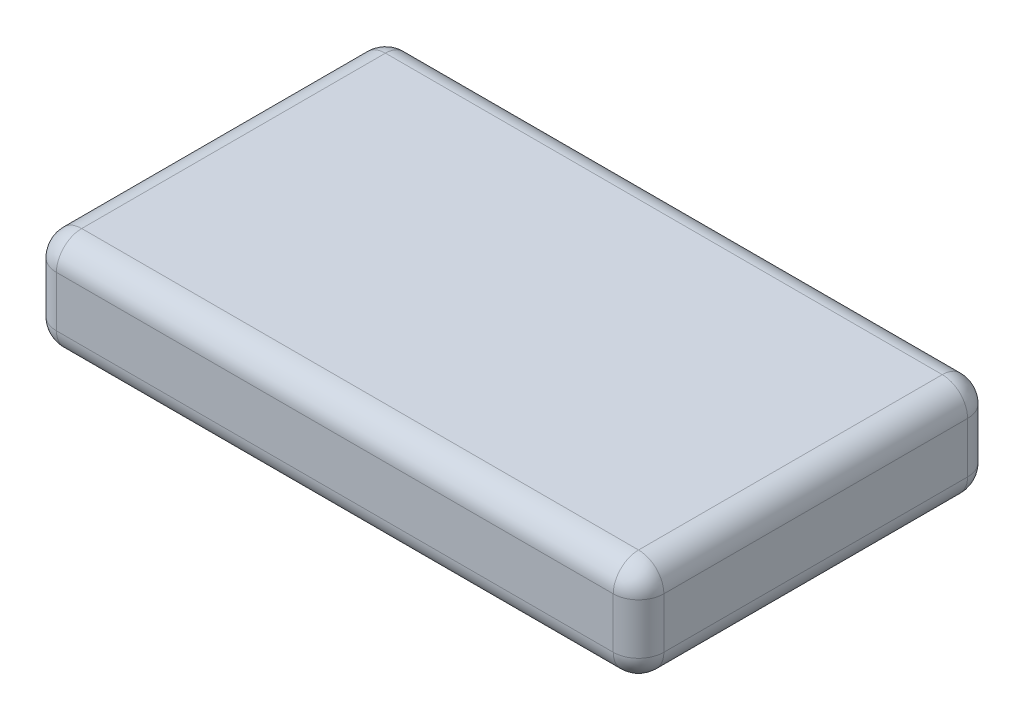
ISO-10303-21;
HEADER;
FILE_DESCRIPTION(('STEP AP214'),'2;1');
FILE_NAME('part.step','',(''),(''),'','','');
FILE_SCHEMA(('AUTOMOTIVE_DESIGN { 1 0 10303 214 1 1 1 1 }'));
ENDSEC;
DATA;
#1=APPLICATION_CONTEXT('core data for automotive mechanical design processes');
#2=APPLICATION_PROTOCOL_DEFINITION('international standard','automotive_design',2000,#1);
#3=PRODUCT_CONTEXT('',#1,'mechanical');
#4=PRODUCT('Part','Part','',(#3));
#5=PRODUCT_RELATED_PRODUCT_CATEGORY('part','',(#4));
#6=PRODUCT_DEFINITION_FORMATION('','',#4);
#7=PRODUCT_DEFINITION_CONTEXT('part definition',#1,'design');
#8=PRODUCT_DEFINITION('design','',#6,#7);
#9=PRODUCT_DEFINITION_SHAPE('','',#8);
#10=(LENGTH_UNIT() NAMED_UNIT(*) SI_UNIT(.MILLI.,.METRE.));
#11=(NAMED_UNIT(*) PLANE_ANGLE_UNIT() SI_UNIT($,.RADIAN.));
#12=(NAMED_UNIT(*) SI_UNIT($,.STERADIAN.) SOLID_ANGLE_UNIT());
#13=UNCERTAINTY_MEASURE_WITH_UNIT(LENGTH_MEASURE(1.E-05),#10,'distance_accuracy_value','');
#14=(GEOMETRIC_REPRESENTATION_CONTEXT(3) GLOBAL_UNCERTAINTY_ASSIGNED_CONTEXT((#13)) GLOBAL_UNIT_ASSIGNED_CONTEXT((#10,
#11,#12)) REPRESENTATION_CONTEXT('',''));
#15=CARTESIAN_POINT('',(0.,0.,0.));
#16=DIRECTION('',(0.,0.,1.));
#17=DIRECTION('',(1.,0.,0.));
#18=AXIS2_PLACEMENT_3D('',#15,#16,#17);
#19=CARTESIAN_POINT('',(0.,101.6,-355.6));
#20=DIRECTION('',(1.,0.,0.));
#21=DIRECTION('',(0.,0.,-1.));
#22=AXIS2_PLACEMENT_3D('',#19,#20,#21);
#23=PLANE('',#22);
#24=DIRECTION('',(0.,0.,1.));
#25=VECTOR('',#24,1.);
#26=CARTESIAN_POINT('',(0.,76.2,-355.6));
#27=LINE('',#26,#25);
#28=CARTESIAN_POINT('',(0.,76.2,-25.4));
#29=VERTEX_POINT('',#28);
#30=CARTESIAN_POINT('',(0.,76.2,-330.2));
#31=VERTEX_POINT('',#30);
#32=EDGE_CURVE('E127',#29,#31,#27,.F.);
#33=ORIENTED_EDGE('',*,*,#32,.T.);
#34=DIRECTION('',(0.,-1.,0.));
#35=VECTOR('',#34,1.);
#36=CARTESIAN_POINT('',(0.,101.6,-330.2));
#37=LINE('',#36,#35);
#38=CARTESIAN_POINT('',(0.,25.4,-330.2));
#39=VERTEX_POINT('',#38);
#40=EDGE_CURVE('E163',#31,#39,#37,.T.);
#41=ORIENTED_EDGE('',*,*,#40,.T.);
#42=DIRECTION('',(0.,0.,1.));
#43=VECTOR('',#42,1.);
#44=CARTESIAN_POINT('',(0.,25.4,-355.6));
#45=LINE('',#44,#43);
#46=CARTESIAN_POINT('',(0.,25.4,-25.4));
#47=VERTEX_POINT('',#46);
#48=EDGE_CURVE('E156',#39,#47,#45,.T.);
#49=ORIENTED_EDGE('',*,*,#48,.T.);
#50=DIRECTION('',(0.,-1.,0.));
#51=VECTOR('',#50,1.);
#52=CARTESIAN_POINT('',(0.,101.6,-25.4));
#53=LINE('',#52,#51);
#54=EDGE_CURVE('E154',#47,#29,#53,.F.);
#55=ORIENTED_EDGE('',*,*,#54,.T.);
#56=EDGE_LOOP('',(#33,#41,#49,#55));
#57=FACE_BOUND('',#56,.T.);
#58=ADVANCED_FACE('F32',(#57),#23,.F.);
#59=CARTESIAN_POINT('',(0.,101.6,0.));
#60=DIRECTION('',(0.,0.,-1.));
#61=DIRECTION('',(-1.,0.,0.));
#62=AXIS2_PLACEMENT_3D('',#59,#60,#61);
#63=PLANE('',#62);
#64=DIRECTION('',(0.,-1.,0.));
#65=VECTOR('',#64,1.);
#66=CARTESIAN_POINT('',(25.4,101.6,0.));
#67=LINE('',#66,#65);
#68=CARTESIAN_POINT('',(25.4,76.2,0.));
#69=VERTEX_POINT('',#68);
#70=CARTESIAN_POINT('',(25.4,25.4,0.));
#71=VERTEX_POINT('',#70);
#72=EDGE_CURVE('E52',#69,#71,#67,.T.);
#73=ORIENTED_EDGE('',*,*,#72,.T.);
#74=DIRECTION('',(1.,0.,0.));
#75=VECTOR('',#74,1.);
#76=CARTESIAN_POINT('',(0.,25.4,0.));
#77=LINE('',#76,#75);
#78=CARTESIAN_POINT('',(584.2,25.4,0.));
#79=VERTEX_POINT('',#78);
#80=EDGE_CURVE('E11',#71,#79,#77,.T.);
#81=ORIENTED_EDGE('',*,*,#80,.T.);
#82=DIRECTION('',(0.,-1.,0.));
#83=VECTOR('',#82,1.);
#84=CARTESIAN_POINT('',(584.2,101.6,0.));
#85=LINE('',#84,#83);
#86=CARTESIAN_POINT('',(584.2,76.2,0.));
#87=VERTEX_POINT('',#86);
#88=EDGE_CURVE('E41',#79,#87,#85,.F.);
#89=ORIENTED_EDGE('',*,*,#88,.T.);
#90=DIRECTION('',(1.,0.,0.));
#91=VECTOR('',#90,1.);
#92=CARTESIAN_POINT('',(0.,76.2,0.));
#93=LINE('',#92,#91);
#94=EDGE_CURVE('E192',#87,#69,#93,.F.);
#95=ORIENTED_EDGE('',*,*,#94,.T.);
#96=EDGE_LOOP('',(#73,#81,#89,#95));
#97=FACE_BOUND('',#96,.T.);
#98=ADVANCED_FACE('F315',(#97),#63,.F.);
#99=CARTESIAN_POINT('',(609.6,101.6,0.));
#100=DIRECTION('',(-1.,0.,0.));
#101=DIRECTION('',(0.,0.,1.));
#102=AXIS2_PLACEMENT_3D('',#99,#100,#101);
#103=PLANE('',#102);
#104=DIRECTION('',(0.,0.,-1.));
#105=VECTOR('',#104,1.);
#106=CARTESIAN_POINT('',(609.6,25.4,0.));
#107=LINE('',#106,#105);
#108=CARTESIAN_POINT('',(609.6,25.4,-25.4));
#109=VERTEX_POINT('',#108);
#110=CARTESIAN_POINT('',(609.6,25.4,-330.2));
#111=VERTEX_POINT('',#110);
#112=EDGE_CURVE('E187',#109,#111,#107,.T.);
#113=ORIENTED_EDGE('',*,*,#112,.T.);
#114=DIRECTION('',(0.,-1.,0.));
#115=VECTOR('',#114,1.);
#116=CARTESIAN_POINT('',(609.6,101.6,-330.2));
#117=LINE('',#116,#115);
#118=CARTESIAN_POINT('',(609.6,76.2,-330.2));
#119=VERTEX_POINT('',#118);
#120=EDGE_CURVE('E189',#111,#119,#117,.F.);
#121=ORIENTED_EDGE('',*,*,#120,.T.);
#122=DIRECTION('',(0.,0.,-1.));
#123=VECTOR('',#122,1.);
#124=CARTESIAN_POINT('',(609.6,76.2,0.));
#125=LINE('',#124,#123);
#126=CARTESIAN_POINT('',(609.6,76.2,-25.4));
#127=VERTEX_POINT('',#126);
#128=EDGE_CURVE('E185',#119,#127,#125,.F.);
#129=ORIENTED_EDGE('',*,*,#128,.T.);
#130=DIRECTION('',(0.,-1.,0.));
#131=VECTOR('',#130,1.);
#132=CARTESIAN_POINT('',(609.6,101.6,-25.4));
#133=LINE('',#132,#131);
#134=EDGE_CURVE('E183',#127,#109,#133,.T.);
#135=ORIENTED_EDGE('',*,*,#134,.T.);
#136=EDGE_LOOP('',(#113,#121,#129,#135));
#137=FACE_BOUND('',#136,.T.);
#138=ADVANCED_FACE('F276',(#137),#103,.F.);
#139=CARTESIAN_POINT('',(609.6,101.6,-355.6));
#140=DIRECTION('',(0.,0.,1.));
#141=DIRECTION('',(1.,0.,0.));
#142=AXIS2_PLACEMENT_3D('',#139,#140,#141);
#143=PLANE('',#142);
#144=DIRECTION('',(-1.,0.,0.));
#145=VECTOR('',#144,1.);
#146=CARTESIAN_POINT('',(609.6,25.4,-355.6));
#147=LINE('',#146,#145);
#148=CARTESIAN_POINT('',(584.2,25.4,-355.6));
#149=VERTEX_POINT('',#148);
#150=CARTESIAN_POINT('',(25.4,25.4,-355.6));
#151=VERTEX_POINT('',#150);
#152=EDGE_CURVE('E178',#149,#151,#147,.T.);
#153=ORIENTED_EDGE('',*,*,#152,.T.);
#154=DIRECTION('',(0.,-1.,0.));
#155=VECTOR('',#154,1.);
#156=CARTESIAN_POINT('',(25.4,101.6,-355.6));
#157=LINE('',#156,#155);
#158=CARTESIAN_POINT('',(25.4,76.2,-355.6));
#159=VERTEX_POINT('',#158);
#160=EDGE_CURVE('E180',#151,#159,#157,.F.);
#161=ORIENTED_EDGE('',*,*,#160,.T.);
#162=DIRECTION('',(-1.,0.,0.));
#163=VECTOR('',#162,1.);
#164=CARTESIAN_POINT('',(609.6,76.2,-355.6));
#165=LINE('',#164,#163);
#166=CARTESIAN_POINT('',(584.2,76.2,-355.6));
#167=VERTEX_POINT('',#166);
#168=EDGE_CURVE('E176',#159,#167,#165,.F.);
#169=ORIENTED_EDGE('',*,*,#168,.T.);
#170=DIRECTION('',(0.,-1.,0.));
#171=VECTOR('',#170,1.);
#172=CARTESIAN_POINT('',(584.2,101.6,-355.6));
#173=LINE('',#172,#171);
#174=EDGE_CURVE('E174',#167,#149,#173,.T.);
#175=ORIENTED_EDGE('',*,*,#174,.T.);
#176=EDGE_LOOP('',(#153,#161,#169,#175));
#177=FACE_BOUND('',#176,.T.);
#178=ADVANCED_FACE('F267',(#177),#143,.F.);
#179=CARTESIAN_POINT('',(0.,101.6,0.));
#180=DIRECTION('',(0.,1.,0.));
#181=DIRECTION('',(0.,0.,1.));
#182=AXIS2_PLACEMENT_3D('',#179,#180,#181);
#183=PLANE('',#182);
#184=DIRECTION('',(-1.,0.,0.));
#185=VECTOR('',#184,1.);
#186=CARTESIAN_POINT('',(0.,101.6,-330.2));
#187=LINE('',#186,#185);
#188=CARTESIAN_POINT('',(584.2,101.6,-330.2));
#189=VERTEX_POINT('',#188);
#190=CARTESIAN_POINT('',(25.4,101.6,-330.2));
#191=VERTEX_POINT('',#190);
#192=EDGE_CURVE('E152',#189,#191,#187,.T.);
#193=ORIENTED_EDGE('',*,*,#192,.T.);
#194=DIRECTION('',(0.,0.,1.));
#195=VECTOR('',#194,1.);
#196=CARTESIAN_POINT('',(25.4,101.6,0.));
#197=LINE('',#196,#195);
#198=CARTESIAN_POINT('',(25.4,101.6,-25.4));
#199=VERTEX_POINT('',#198);
#200=EDGE_CURVE('E125',#191,#199,#197,.T.);
#201=ORIENTED_EDGE('',*,*,#200,.T.);
#202=DIRECTION('',(1.,0.,0.));
#203=VECTOR('',#202,1.);
#204=CARTESIAN_POINT('',(609.6,101.6,-25.4));
#205=LINE('',#204,#203);
#206=CARTESIAN_POINT('',(584.2,101.6,-25.4));
#207=VERTEX_POINT('',#206);
#208=EDGE_CURVE('E142',#199,#207,#205,.T.);
#209=ORIENTED_EDGE('',*,*,#208,.T.);
#210=DIRECTION('',(0.,0.,-1.));
#211=VECTOR('',#210,1.);
#212=CARTESIAN_POINT('',(584.2,101.6,-355.6));
#213=LINE('',#212,#211);
#214=EDGE_CURVE('E148',#207,#189,#213,.T.);
#215=ORIENTED_EDGE('',*,*,#214,.T.);
#216=EDGE_LOOP('',(#193,#201,#209,#215));
#217=FACE_BOUND('',#216,.T.);
#218=ADVANCED_FACE('F150',(#217),#183,.T.);
#219=CARTESIAN_POINT('',(0.,0.,0.));
#220=DIRECTION('',(0.,1.,0.));
#221=DIRECTION('',(0.,0.,1.));
#222=AXIS2_PLACEMENT_3D('',#219,#220,#221);
#223=PLANE('',#222);
#224=DIRECTION('',(1.,0.,0.));
#225=VECTOR('',#224,1.);
#226=CARTESIAN_POINT('',(0.,0.,-25.4));
#227=LINE('',#226,#225);
#228=CARTESIAN_POINT('',(584.2,0.,-25.4));
#229=VERTEX_POINT('',#228);
#230=CARTESIAN_POINT('',(25.4,0.,-25.4));
#231=VERTEX_POINT('',#230);
#232=EDGE_CURVE('E165',#229,#231,#227,.F.);
#233=ORIENTED_EDGE('',*,*,#232,.T.);
#234=DIRECTION('',(0.,0.,1.));
#235=VECTOR('',#234,1.);
#236=CARTESIAN_POINT('',(25.4,0.,0.));
#237=LINE('',#236,#235);
#238=CARTESIAN_POINT('',(25.4,0.,-330.2));
#239=VERTEX_POINT('',#238);
#240=EDGE_CURVE('E171',#231,#239,#237,.F.);
#241=ORIENTED_EDGE('',*,*,#240,.T.);
#242=DIRECTION('',(-1.,0.,0.));
#243=VECTOR('',#242,1.);
#244=CARTESIAN_POINT('',(0.,0.,-330.2));
#245=LINE('',#244,#243);
#246=CARTESIAN_POINT('',(584.2,0.,-330.2));
#247=VERTEX_POINT('',#246);
#248=EDGE_CURVE('E169',#239,#247,#245,.F.);
#249=ORIENTED_EDGE('',*,*,#248,.T.);
#250=DIRECTION('',(0.,0.,-1.));
#251=VECTOR('',#250,1.);
#252=CARTESIAN_POINT('',(584.2,0.,0.));
#253=LINE('',#252,#251);
#254=EDGE_CURVE('E167',#247,#229,#253,.F.);
#255=ORIENTED_EDGE('',*,*,#254,.T.);
#256=EDGE_LOOP('',(#233,#241,#249,#255));
#257=FACE_BOUND('',#256,.T.);
#258=ADVANCED_FACE('F286',(#257),#223,.F.);
#259=CARTESIAN_POINT('',(584.2,25.4,0.));
#260=DIRECTION('',(0.,0.,-1.));
#261=DIRECTION('',(-1.,0.,0.));
#262=AXIS2_PLACEMENT_3D('',#259,#260,#261);
#263=CYLINDRICAL_SURFACE('',#262,25.4);
#264=CARTESIAN_POINT('',(584.2,25.4,-330.2));
#265=DIRECTION('',(0.,0.,-1.));
#266=DIRECTION('',(-1.,0.,0.));
#267=AXIS2_PLACEMENT_3D('',#264,#265,#266);
#268=CIRCLE('',#267,25.4);
#269=EDGE_CURVE('E36',#111,#247,#268,.T.);
#270=ORIENTED_EDGE('',*,*,#269,.F.);
#271=ORIENTED_EDGE('',*,*,#112,.F.);
#272=CARTESIAN_POINT('',(584.2,25.4,-25.4));
#273=DIRECTION('',(0.,0.,1.));
#274=DIRECTION('',(1.,0.,0.));
#275=AXIS2_PLACEMENT_3D('',#272,#273,#274);
#276=CIRCLE('',#275,25.4);
#277=EDGE_CURVE('E244',#229,#109,#276,.T.);
#278=ORIENTED_EDGE('',*,*,#277,.F.);
#279=ORIENTED_EDGE('',*,*,#254,.F.);
#280=EDGE_LOOP('',(#270,#271,#278,#279));
#281=FACE_BOUND('',#280,.T.);
#282=ADVANCED_FACE('F34',(#281),#263,.T.);
#283=CARTESIAN_POINT('',(584.2,25.4,-330.2));
#284=DIRECTION('',(0.,0.,1.));
#285=DIRECTION('',(1.,0.,0.));
#286=AXIS2_PLACEMENT_3D('',#283,#284,#285);
#287=SPHERICAL_SURFACE('',#286,25.4);
#288=CARTESIAN_POINT('',(584.2,25.4,-330.2));
#289=DIRECTION('',(0.,-1.,0.));
#290=DIRECTION('',(0.,0.,-1.));
#291=AXIS2_PLACEMENT_3D('',#288,#289,#290);
#292=CIRCLE('',#291,25.4);
#293=EDGE_CURVE('E239',#111,#149,#292,.F.);
#294=ORIENTED_EDGE('',*,*,#293,.F.);
#295=ORIENTED_EDGE('',*,*,#269,.T.);
#296=CARTESIAN_POINT('',(584.2,25.4,-330.2));
#297=DIRECTION('',(1.,0.,0.));
#298=DIRECTION('',(0.,0.,-1.));
#299=AXIS2_PLACEMENT_3D('',#296,#297,#298);
#300=CIRCLE('',#299,25.4);
#301=EDGE_CURVE('E242',#149,#247,#300,.F.);
#302=ORIENTED_EDGE('',*,*,#301,.F.);
#303=EDGE_LOOP('',(#294,#295,#302));
#304=FACE_BOUND('',#303,.T.);
#305=ADVANCED_FACE('F255',(#304),#287,.T.);
#306=CARTESIAN_POINT('',(584.2,25.4,-25.4));
#307=DIRECTION('',(0.,0.,1.));
#308=DIRECTION('',(1.,0.,0.));
#309=AXIS2_PLACEMENT_3D('',#306,#307,#308);
#310=SPHERICAL_SURFACE('',#309,25.4);
#311=CARTESIAN_POINT('',(584.2,25.4,-25.4));
#312=DIRECTION('',(1.,0.,0.));
#313=DIRECTION('',(0.,0.,-1.));
#314=AXIS2_PLACEMENT_3D('',#311,#312,#313);
#315=CIRCLE('',#314,25.4);
#316=EDGE_CURVE('E234',#229,#79,#315,.F.);
#317=ORIENTED_EDGE('',*,*,#316,.F.);
#318=ORIENTED_EDGE('',*,*,#277,.T.);
#319=CARTESIAN_POINT('',(584.2,25.4,-25.4));
#320=DIRECTION('',(0.,-1.,0.));
#321=DIRECTION('',(0.,0.,-1.));
#322=AXIS2_PLACEMENT_3D('',#319,#320,#321);
#323=CIRCLE('',#322,25.4);
#324=EDGE_CURVE('E236',#79,#109,#323,.F.);
#325=ORIENTED_EDGE('',*,*,#324,.F.);
#326=EDGE_LOOP('',(#317,#318,#325));
#327=FACE_BOUND('',#326,.T.);
#328=ADVANCED_FACE('F279',(#327),#310,.T.);
#329=CARTESIAN_POINT('',(609.6,25.4,-330.2));
#330=DIRECTION('',(-1.,0.,0.));
#331=DIRECTION('',(0.,0.,1.));
#332=AXIS2_PLACEMENT_3D('',#329,#330,#331);
#333=CYLINDRICAL_SURFACE('',#332,25.4);
#334=ORIENTED_EDGE('',*,*,#301,.T.);
#335=ORIENTED_EDGE('',*,*,#248,.F.);
#336=CARTESIAN_POINT('',(25.4,25.4,-330.2));
#337=DIRECTION('',(-1.,0.,0.));
#338=DIRECTION('',(0.,0.,1.));
#339=AXIS2_PLACEMENT_3D('',#336,#337,#338);
#340=CIRCLE('',#339,25.4);
#341=EDGE_CURVE('E229',#151,#239,#340,.T.);
#342=ORIENTED_EDGE('',*,*,#341,.F.);
#343=ORIENTED_EDGE('',*,*,#152,.F.);
#344=EDGE_LOOP('',(#334,#335,#342,#343));
#345=FACE_BOUND('',#344,.T.);
#346=ADVANCED_FACE('F263',(#345),#333,.T.);
#347=CARTESIAN_POINT('',(584.2,101.6,-330.2));
#348=DIRECTION('',(0.,-1.,0.));
#349=DIRECTION('',(0.,0.,-1.));
#350=AXIS2_PLACEMENT_3D('',#347,#348,#349);
#351=CYLINDRICAL_SURFACE('',#350,25.4);
#352=ORIENTED_EDGE('',*,*,#293,.T.);
#353=ORIENTED_EDGE('',*,*,#174,.F.);
#354=CARTESIAN_POINT('',(584.2,76.2,-330.2));
#355=DIRECTION('',(0.,1.,0.));
#356=DIRECTION('',(0.,0.,1.));
#357=AXIS2_PLACEMENT_3D('',#354,#355,#356);
#358=CIRCLE('',#357,25.4);
#359=EDGE_CURVE('E226',#119,#167,#358,.T.);
#360=ORIENTED_EDGE('',*,*,#359,.F.);
#361=ORIENTED_EDGE('',*,*,#120,.F.);
#362=EDGE_LOOP('',(#352,#353,#360,#361));
#363=FACE_BOUND('',#362,.T.);
#364=ADVANCED_FACE('F273',(#363),#351,.T.);
#365=CARTESIAN_POINT('',(584.2,76.2,0.));
#366=DIRECTION('',(0.,0.,1.));
#367=DIRECTION('',(1.,0.,0.));
#368=AXIS2_PLACEMENT_3D('',#365,#366,#367);
#369=CYLINDRICAL_SURFACE('',#368,25.4);
#370=CARTESIAN_POINT('',(584.2,76.2,-25.4));
#371=DIRECTION('',(0.,0.,1.));
#372=DIRECTION('',(1.,0.,0.));
#373=AXIS2_PLACEMENT_3D('',#370,#371,#372);
#374=CIRCLE('',#373,25.4);
#375=EDGE_CURVE('E221',#127,#207,#374,.T.);
#376=ORIENTED_EDGE('',*,*,#375,.F.);
#377=ORIENTED_EDGE('',*,*,#128,.F.);
#378=CARTESIAN_POINT('',(584.2,76.2,-330.2));
#379=DIRECTION('',(0.,0.,-1.));
#380=DIRECTION('',(-1.,0.,0.));
#381=AXIS2_PLACEMENT_3D('',#378,#379,#380);
#382=CIRCLE('',#381,25.4);
#383=EDGE_CURVE('E224',#189,#119,#382,.T.);
#384=ORIENTED_EDGE('',*,*,#383,.F.);
#385=ORIENTED_EDGE('',*,*,#214,.F.);
#386=EDGE_LOOP('',(#376,#377,#384,#385));
#387=FACE_BOUND('',#386,.T.);
#388=ADVANCED_FACE('F309',(#387),#369,.T.);
#389=CARTESIAN_POINT('',(584.2,101.6,-25.4));
#390=DIRECTION('',(0.,-1.,0.));
#391=DIRECTION('',(0.,0.,-1.));
#392=AXIS2_PLACEMENT_3D('',#389,#390,#391);
#393=CYLINDRICAL_SURFACE('',#392,25.4);
#394=ORIENTED_EDGE('',*,*,#324,.T.);
#395=ORIENTED_EDGE('',*,*,#134,.F.);
#396=CARTESIAN_POINT('',(584.2,76.2,-25.4));
#397=DIRECTION('',(0.,1.,0.));
#398=DIRECTION('',(0.,0.,1.));
#399=AXIS2_PLACEMENT_3D('',#396,#397,#398);
#400=CIRCLE('',#399,25.4);
#401=EDGE_CURVE('E218',#87,#127,#400,.T.);
#402=ORIENTED_EDGE('',*,*,#401,.F.);
#403=ORIENTED_EDGE('',*,*,#88,.F.);
#404=EDGE_LOOP('',(#394,#395,#402,#403));
#405=FACE_BOUND('',#404,.T.);
#406=ADVANCED_FACE('F314',(#405),#393,.T.);
#407=CARTESIAN_POINT('',(0.,25.4,-25.4));
#408=DIRECTION('',(1.,0.,0.));
#409=DIRECTION('',(0.,0.,-1.));
#410=AXIS2_PLACEMENT_3D('',#407,#408,#409);
#411=CYLINDRICAL_SURFACE('',#410,25.4);
#412=ORIENTED_EDGE('',*,*,#316,.T.);
#413=ORIENTED_EDGE('',*,*,#80,.F.);
#414=CARTESIAN_POINT('',(25.4,25.4,-25.4));
#415=DIRECTION('',(-1.,0.,0.));
#416=DIRECTION('',(0.,0.,1.));
#417=AXIS2_PLACEMENT_3D('',#414,#415,#416);
#418=CIRCLE('',#417,25.4);
#419=EDGE_CURVE('E215',#231,#71,#418,.T.);
#420=ORIENTED_EDGE('',*,*,#419,.F.);
#421=ORIENTED_EDGE('',*,*,#232,.F.);
#422=EDGE_LOOP('',(#412,#413,#420,#421));
#423=FACE_BOUND('',#422,.T.);
#424=ADVANCED_FACE('F283',(#423),#411,.T.);
#425=CARTESIAN_POINT('',(25.4,25.4,-355.6));
#426=DIRECTION('',(0.,0.,1.));
#427=DIRECTION('',(1.,0.,0.));
#428=AXIS2_PLACEMENT_3D('',#425,#426,#427);
#429=CYLINDRICAL_SURFACE('',#428,25.4);
#430=CARTESIAN_POINT('',(25.4,25.4,-330.2));
#431=DIRECTION('',(0.,0.,-1.));
#432=DIRECTION('',(-1.,0.,0.));
#433=AXIS2_PLACEMENT_3D('',#430,#431,#432);
#434=CIRCLE('',#433,25.4);
#435=EDGE_CURVE('E231',#239,#39,#434,.T.);
#436=ORIENTED_EDGE('',*,*,#435,.F.);
#437=ORIENTED_EDGE('',*,*,#240,.F.);
#438=CARTESIAN_POINT('',(25.4,25.4,-25.4));
#439=DIRECTION('',(0.,0.,1.));
#440=DIRECTION('',(1.,0.,0.));
#441=AXIS2_PLACEMENT_3D('',#438,#439,#440);
#442=CIRCLE('',#441,25.4);
#443=EDGE_CURVE('E212',#47,#231,#442,.T.);
#444=ORIENTED_EDGE('',*,*,#443,.F.);
#445=ORIENTED_EDGE('',*,*,#48,.F.);
#446=EDGE_LOOP('',(#436,#437,#444,#445));
#447=FACE_BOUND('',#446,.T.);
#448=ADVANCED_FACE('F290',(#447),#429,.T.);
#449=CARTESIAN_POINT('',(25.4,25.4,-330.2));
#450=DIRECTION('',(0.,0.,1.));
#451=DIRECTION('',(1.,0.,0.));
#452=AXIS2_PLACEMENT_3D('',#449,#450,#451);
#453=SPHERICAL_SURFACE('',#452,25.4);
#454=ORIENTED_EDGE('',*,*,#341,.T.);
#455=ORIENTED_EDGE('',*,*,#435,.T.);
#456=CARTESIAN_POINT('',(25.4,25.4,-330.2));
#457=DIRECTION('',(0.,-1.,0.));
#458=DIRECTION('',(0.,0.,-1.));
#459=AXIS2_PLACEMENT_3D('',#456,#457,#458);
#460=CIRCLE('',#459,25.4);
#461=EDGE_CURVE('E209',#151,#39,#460,.F.);
#462=ORIENTED_EDGE('',*,*,#461,.F.);
#463=EDGE_LOOP('',(#454,#455,#462));
#464=FACE_BOUND('',#463,.T.);
#465=ADVANCED_FACE('F294',(#464),#453,.T.);
#466=CARTESIAN_POINT('',(584.2,76.2,-330.2));
#467=DIRECTION('',(0.,0.,1.));
#468=DIRECTION('',(1.,0.,0.));
#469=AXIS2_PLACEMENT_3D('',#466,#467,#468);
#470=SPHERICAL_SURFACE('',#469,25.4);
#471=ORIENTED_EDGE('',*,*,#383,.T.);
#472=ORIENTED_EDGE('',*,*,#359,.T.);
#473=CARTESIAN_POINT('',(584.2,76.2,-330.2));
#474=DIRECTION('',(1.,0.,0.));
#475=DIRECTION('',(0.,0.,-1.));
#476=AXIS2_PLACEMENT_3D('',#473,#474,#475);
#477=CIRCLE('',#476,25.4);
#478=EDGE_CURVE('E206',#189,#167,#477,.F.);
#479=ORIENTED_EDGE('',*,*,#478,.F.);
#480=EDGE_LOOP('',(#471,#472,#479));
#481=FACE_BOUND('',#480,.T.);
#482=ADVANCED_FACE('F305',(#481),#470,.T.);
#483=CARTESIAN_POINT('',(584.2,76.2,-25.4));
#484=DIRECTION('',(0.,0.,1.));
#485=DIRECTION('',(1.,0.,0.));
#486=AXIS2_PLACEMENT_3D('',#483,#484,#485);
#487=SPHERICAL_SURFACE('',#486,25.4);
#488=ORIENTED_EDGE('',*,*,#401,.T.);
#489=ORIENTED_EDGE('',*,*,#375,.T.);
#490=CARTESIAN_POINT('',(584.2,76.2,-25.4));
#491=DIRECTION('',(1.,0.,0.));
#492=DIRECTION('',(0.,0.,-1.));
#493=AXIS2_PLACEMENT_3D('',#490,#491,#492);
#494=CIRCLE('',#493,25.4);
#495=EDGE_CURVE('E145',#87,#207,#494,.F.);
#496=ORIENTED_EDGE('',*,*,#495,.F.);
#497=EDGE_LOOP('',(#488,#489,#496));
#498=FACE_BOUND('',#497,.T.);
#499=ADVANCED_FACE('F312',(#498),#487,.T.);
#500=CARTESIAN_POINT('',(25.4,25.4,-25.4));
#501=DIRECTION('',(0.,0.,1.));
#502=DIRECTION('',(1.,0.,0.));
#503=AXIS2_PLACEMENT_3D('',#500,#501,#502);
#504=SPHERICAL_SURFACE('',#503,25.4);
#505=ORIENTED_EDGE('',*,*,#443,.T.);
#506=ORIENTED_EDGE('',*,*,#419,.T.);
#507=CARTESIAN_POINT('',(25.4,25.4,-25.4));
#508=DIRECTION('',(0.,-1.,0.));
#509=DIRECTION('',(0.,0.,-1.));
#510=AXIS2_PLACEMENT_3D('',#507,#508,#509);
#511=CIRCLE('',#510,25.4);
#512=EDGE_CURVE('E202',#47,#71,#511,.F.);
#513=ORIENTED_EDGE('',*,*,#512,.F.);
#514=EDGE_LOOP('',(#505,#506,#513));
#515=FACE_BOUND('',#514,.T.);
#516=ADVANCED_FACE('F320',(#515),#504,.T.);
#517=CARTESIAN_POINT('',(25.4,101.6,-330.2));
#518=DIRECTION('',(0.,-1.,0.));
#519=DIRECTION('',(0.,0.,-1.));
#520=AXIS2_PLACEMENT_3D('',#517,#518,#519);
#521=CYLINDRICAL_SURFACE('',#520,25.4);
#522=ORIENTED_EDGE('',*,*,#461,.T.);
#523=ORIENTED_EDGE('',*,*,#40,.F.);
#524=CARTESIAN_POINT('',(25.4,76.2,-330.2));
#525=DIRECTION('',(0.,1.,0.));
#526=DIRECTION('',(0.,0.,1.));
#527=AXIS2_PLACEMENT_3D('',#524,#525,#526);
#528=CIRCLE('',#527,25.4);
#529=EDGE_CURVE('E199',#159,#31,#528,.T.);
#530=ORIENTED_EDGE('',*,*,#529,.F.);
#531=ORIENTED_EDGE('',*,*,#160,.F.);
#532=EDGE_LOOP('',(#522,#523,#530,#531));
#533=FACE_BOUND('',#532,.T.);
#534=ADVANCED_FACE('F297',(#533),#521,.T.);
#535=CARTESIAN_POINT('',(0.,76.2,-330.2));
#536=DIRECTION('',(1.,0.,0.));
#537=DIRECTION('',(0.,0.,-1.));
#538=AXIS2_PLACEMENT_3D('',#535,#536,#537);
#539=CYLINDRICAL_SURFACE('',#538,25.4);
#540=ORIENTED_EDGE('',*,*,#478,.T.);
#541=ORIENTED_EDGE('',*,*,#168,.F.);
#542=CARTESIAN_POINT('',(25.4,76.2,-330.2));
#543=DIRECTION('',(-1.,0.,0.));
#544=DIRECTION('',(0.,0.,1.));
#545=AXIS2_PLACEMENT_3D('',#542,#543,#544);
#546=CIRCLE('',#545,25.4);
#547=EDGE_CURVE('E139',#191,#159,#546,.T.);
#548=ORIENTED_EDGE('',*,*,#547,.F.);
#549=ORIENTED_EDGE('',*,*,#192,.F.);
#550=EDGE_LOOP('',(#540,#541,#548,#549));
#551=FACE_BOUND('',#550,.T.);
#552=ADVANCED_FACE('F302',(#551),#539,.T.);
#553=CARTESIAN_POINT('',(0.,76.2,-25.4));
#554=DIRECTION('',(-1.,0.,0.));
#555=DIRECTION('',(0.,0.,1.));
#556=AXIS2_PLACEMENT_3D('',#553,#554,#555);
#557=CYLINDRICAL_SURFACE('',#556,25.4);
#558=ORIENTED_EDGE('',*,*,#495,.T.);
#559=ORIENTED_EDGE('',*,*,#208,.F.);
#560=CARTESIAN_POINT('',(25.4,76.2,-25.4));
#561=DIRECTION('',(-1.,0.,0.));
#562=DIRECTION('',(0.,0.,1.));
#563=AXIS2_PLACEMENT_3D('',#560,#561,#562);
#564=CIRCLE('',#563,25.4);
#565=EDGE_CURVE('E133',#69,#199,#564,.T.);
#566=ORIENTED_EDGE('',*,*,#565,.F.);
#567=ORIENTED_EDGE('',*,*,#94,.F.);
#568=EDGE_LOOP('',(#558,#559,#566,#567));
#569=FACE_BOUND('',#568,.T.);
#570=ADVANCED_FACE('F143',(#569),#557,.T.);
#571=CARTESIAN_POINT('',(25.4,101.6,-25.4));
#572=DIRECTION('',(0.,-1.,0.));
#573=DIRECTION('',(0.,0.,-1.));
#574=AXIS2_PLACEMENT_3D('',#571,#572,#573);
#575=CYLINDRICAL_SURFACE('',#574,25.4);
#576=ORIENTED_EDGE('',*,*,#512,.T.);
#577=ORIENTED_EDGE('',*,*,#72,.F.);
#578=CARTESIAN_POINT('',(25.4,76.2,-25.4));
#579=DIRECTION('',(0.,1.,0.));
#580=DIRECTION('',(0.,0.,1.));
#581=AXIS2_PLACEMENT_3D('',#578,#579,#580);
#582=CIRCLE('',#581,25.4);
#583=EDGE_CURVE('E137',#29,#69,#582,.T.);
#584=ORIENTED_EDGE('',*,*,#583,.F.);
#585=ORIENTED_EDGE('',*,*,#54,.F.);
#586=EDGE_LOOP('',(#576,#577,#584,#585));
#587=FACE_BOUND('',#586,.T.);
#588=ADVANCED_FACE('F317',(#587),#575,.T.);
#589=CARTESIAN_POINT('',(25.4,76.2,-330.2));
#590=DIRECTION('',(0.,0.,1.));
#591=DIRECTION('',(1.,0.,0.));
#592=AXIS2_PLACEMENT_3D('',#589,#590,#591);
#593=SPHERICAL_SURFACE('',#592,25.4);
#594=ORIENTED_EDGE('',*,*,#547,.T.);
#595=ORIENTED_EDGE('',*,*,#529,.T.);
#596=CARTESIAN_POINT('',(25.4,76.2,-330.2));
#597=DIRECTION('',(0.,0.,-1.));
#598=DIRECTION('',(-1.,0.,0.));
#599=AXIS2_PLACEMENT_3D('',#596,#597,#598);
#600=CIRCLE('',#599,25.4);
#601=EDGE_CURVE('E130',#191,#31,#600,.F.);
#602=ORIENTED_EDGE('',*,*,#601,.F.);
#603=EDGE_LOOP('',(#594,#595,#602));
#604=FACE_BOUND('',#603,.T.);
#605=ADVANCED_FACE('F342',(#604),#593,.T.);
#606=CARTESIAN_POINT('',(25.4,76.2,-25.4));
#607=DIRECTION('',(0.,0.,1.));
#608=DIRECTION('',(1.,0.,0.));
#609=AXIS2_PLACEMENT_3D('',#606,#607,#608);
#610=SPHERICAL_SURFACE('',#609,25.4);
#611=ORIENTED_EDGE('',*,*,#583,.T.);
#612=ORIENTED_EDGE('',*,*,#565,.T.);
#613=CARTESIAN_POINT('',(25.4,76.2,-25.4));
#614=DIRECTION('',(0.,0.,1.));
#615=DIRECTION('',(1.,0.,0.));
#616=AXIS2_PLACEMENT_3D('',#613,#614,#615);
#617=CIRCLE('',#616,25.4);
#618=EDGE_CURVE('E121',#29,#199,#617,.F.);
#619=ORIENTED_EDGE('',*,*,#618,.F.);
#620=EDGE_LOOP('',(#611,#612,#619));
#621=FACE_BOUND('',#620,.T.);
#622=ADVANCED_FACE('F135',(#621),#610,.T.);
#623=CARTESIAN_POINT('',(25.4,76.2,0.));
#624=DIRECTION('',(0.,0.,-1.));
#625=DIRECTION('',(-1.,0.,0.));
#626=AXIS2_PLACEMENT_3D('',#623,#624,#625);
#627=CYLINDRICAL_SURFACE('',#626,25.4);
#628=ORIENTED_EDGE('',*,*,#601,.T.);
#629=ORIENTED_EDGE('',*,*,#32,.F.);
#630=ORIENTED_EDGE('',*,*,#618,.T.);
#631=ORIENTED_EDGE('',*,*,#200,.F.);
#632=EDGE_LOOP('',(#628,#629,#630,#631));
#633=FACE_BOUND('',#632,.T.);
#634=ADVANCED_FACE('F123',(#633),#627,.T.);
#635=CLOSED_SHELL('',(#58,#98,#138,#178,#218,#258,#282,#305,#328,#346,#364,#388,#406,#424,#448,
#465,#482,#499,#516,#534,#552,#570,#588,#605,#622,#634));
#636=MANIFOLD_SOLID_BREP('B2',#635);
#637=ADVANCED_BREP_SHAPE_REPRESENTATION('',(#18,#636),#14);
#638=SHAPE_DEFINITION_REPRESENTATION(#9,#637);
ENDSEC;
END-ISO-10303-21;
